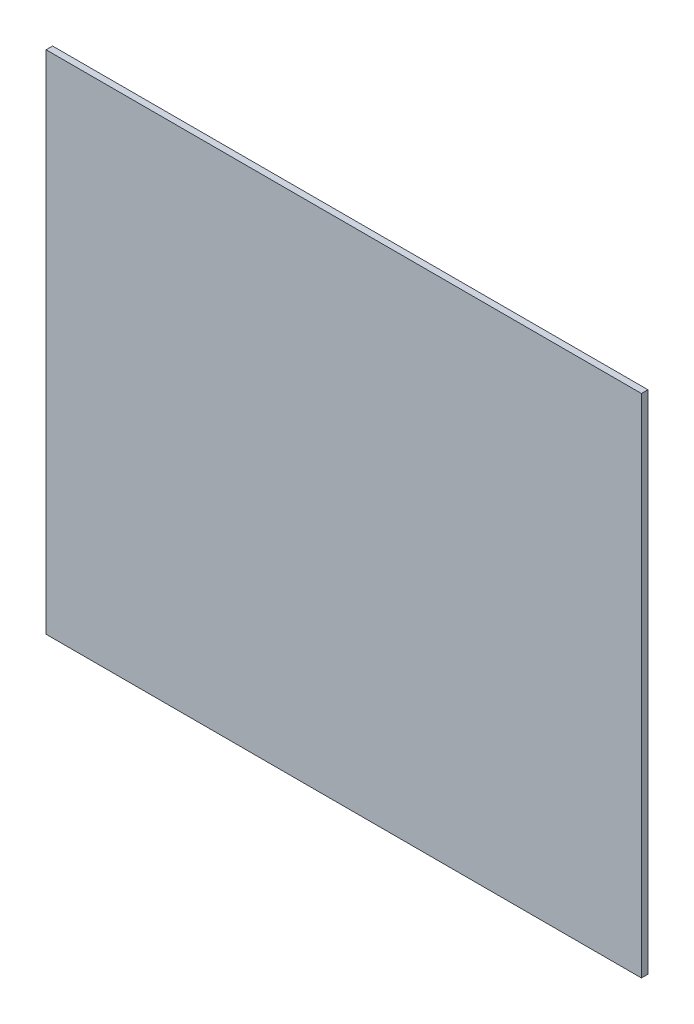
ISO-10303-21;
HEADER;
FILE_DESCRIPTION(('STEP AP214'),'2;1');
FILE_NAME('part.step','',(''),(''),'','','');
FILE_SCHEMA(('AUTOMOTIVE_DESIGN { 1 0 10303 214 1 1 1 1 }'));
ENDSEC;
DATA;
#1=APPLICATION_CONTEXT('core data for automotive mechanical design processes');
#2=APPLICATION_PROTOCOL_DEFINITION('international standard','automotive_design',2000,#1);
#3=PRODUCT_CONTEXT('',#1,'mechanical');
#4=PRODUCT('Part','Part','',(#3));
#5=PRODUCT_RELATED_PRODUCT_CATEGORY('part','',(#4));
#6=PRODUCT_DEFINITION_FORMATION('','',#4);
#7=PRODUCT_DEFINITION_CONTEXT('part definition',#1,'design');
#8=PRODUCT_DEFINITION('design','',#6,#7);
#9=PRODUCT_DEFINITION_SHAPE('','',#8);
#10=(LENGTH_UNIT() NAMED_UNIT(*) SI_UNIT(.MILLI.,.METRE.));
#11=(NAMED_UNIT(*) PLANE_ANGLE_UNIT() SI_UNIT($,.RADIAN.));
#12=(NAMED_UNIT(*) SI_UNIT($,.STERADIAN.) SOLID_ANGLE_UNIT());
#13=UNCERTAINTY_MEASURE_WITH_UNIT(LENGTH_MEASURE(1.E-05),#10,'distance_accuracy_value','');
#14=(GEOMETRIC_REPRESENTATION_CONTEXT(3) GLOBAL_UNCERTAINTY_ASSIGNED_CONTEXT((#13)) GLOBAL_UNIT_ASSIGNED_CONTEXT((#10,
#11,#12)) REPRESENTATION_CONTEXT('',''));
#15=CARTESIAN_POINT('',(0.,0.,0.));
#16=DIRECTION('',(0.,0.,1.));
#17=DIRECTION('',(1.,0.,0.));
#18=AXIS2_PLACEMENT_3D('',#15,#16,#17);
#19=CARTESIAN_POINT('',(-47.1466666666667,40.0228571428571,1.));
#20=DIRECTION('',(1.,0.,0.));
#21=DIRECTION('',(0.,0.,-1.));
#22=AXIS2_PLACEMENT_3D('',#19,#20,#21);
#23=PLANE('',#22);
#24=DIRECTION('',(0.,-1.,0.));
#25=VECTOR('',#24,1.);
#26=CARTESIAN_POINT('',(-47.1466666666667,40.0228571428571,0.));
#27=LINE('',#26,#25);
#28=CARTESIAN_POINT('',(-47.1466666666667,40.0228571428571,0.));
#29=VERTEX_POINT('',#28);
#30=CARTESIAN_POINT('',(-47.1466666666667,-37.9504761904762,0.));
#31=VERTEX_POINT('',#30);
#32=EDGE_CURVE('E96',#29,#31,#27,.T.);
#33=ORIENTED_EDGE('',*,*,#32,.T.);
#34=DIRECTION('',(0.,0.,-1.));
#35=VECTOR('',#34,1.);
#36=CARTESIAN_POINT('',(-47.1466666666667,-37.9504761904762,1.));
#37=LINE('',#36,#35);
#38=CARTESIAN_POINT('',(-47.1466666666667,-37.9504761904762,1.));
#39=VERTEX_POINT('',#38);
#40=EDGE_CURVE('E11',#39,#31,#37,.T.);
#41=ORIENTED_EDGE('',*,*,#40,.F.);
#42=DIRECTION('',(0.,-1.,0.));
#43=VECTOR('',#42,1.);
#44=CARTESIAN_POINT('',(-47.1466666666667,40.0228571428571,1.));
#45=LINE('',#44,#43);
#46=CARTESIAN_POINT('',(-47.1466666666667,40.0228571428571,1.));
#47=VERTEX_POINT('',#46);
#48=EDGE_CURVE('E84',#47,#39,#45,.T.);
#49=ORIENTED_EDGE('',*,*,#48,.F.);
#50=DIRECTION('',(0.,0.,-1.));
#51=VECTOR('',#50,1.);
#52=CARTESIAN_POINT('',(-47.1466666666667,40.0228571428571,1.));
#53=LINE('',#52,#51);
#54=EDGE_CURVE('E92',#47,#29,#53,.T.);
#55=ORIENTED_EDGE('',*,*,#54,.T.);
#56=EDGE_LOOP('',(#33,#41,#49,#55));
#57=FACE_BOUND('',#56,.T.);
#58=ADVANCED_FACE('F33',(#57),#23,.F.);
#59=CARTESIAN_POINT('',(-47.1466666666667,-37.9504761904762,1.));
#60=DIRECTION('',(0.,1.,0.));
#61=DIRECTION('',(0.,0.,1.));
#62=AXIS2_PLACEMENT_3D('',#59,#60,#61);
#63=PLANE('',#62);
#64=DIRECTION('',(1.,0.,0.));
#65=VECTOR('',#64,1.);
#66=CARTESIAN_POINT('',(-47.1466666666667,-37.9504761904762,0.));
#67=LINE('',#66,#65);
#68=CARTESIAN_POINT('',(44.5561904761905,-37.9504761904762,0.));
#69=VERTEX_POINT('',#68);
#70=EDGE_CURVE('E88',#31,#69,#67,.T.);
#71=ORIENTED_EDGE('',*,*,#70,.T.);
#72=DIRECTION('',(0.,0.,-1.));
#73=VECTOR('',#72,1.);
#74=CARTESIAN_POINT('',(44.5561904761905,-37.9504761904762,1.));
#75=LINE('',#74,#73);
#76=CARTESIAN_POINT('',(44.5561904761905,-37.9504761904762,1.));
#77=VERTEX_POINT('',#76);
#78=EDGE_CURVE('E41',#77,#69,#75,.T.);
#79=ORIENTED_EDGE('',*,*,#78,.F.);
#80=DIRECTION('',(1.,0.,0.));
#81=VECTOR('',#80,1.);
#82=CARTESIAN_POINT('',(-47.1466666666667,-37.9504761904762,1.));
#83=LINE('',#82,#81);
#84=EDGE_CURVE('E79',#39,#77,#83,.T.);
#85=ORIENTED_EDGE('',*,*,#84,.F.);
#86=ORIENTED_EDGE('',*,*,#40,.T.);
#87=EDGE_LOOP('',(#71,#79,#85,#86));
#88=FACE_BOUND('',#87,.T.);
#89=ADVANCED_FACE('F87',(#88),#63,.F.);
#90=CARTESIAN_POINT('',(44.5561904761905,40.0228571428571,1.));
#91=DIRECTION('',(-1.,0.,0.));
#92=DIRECTION('',(0.,0.,1.));
#93=AXIS2_PLACEMENT_3D('',#90,#91,#92);
#94=PLANE('',#93);
#95=DIRECTION('',(0.,1.,0.));
#96=VECTOR('',#95,1.);
#97=CARTESIAN_POINT('',(44.5561904761905,40.0228571428571,0.));
#98=LINE('',#97,#96);
#99=CARTESIAN_POINT('',(44.5561904761905,40.0228571428571,0.));
#100=VERTEX_POINT('',#99);
#101=EDGE_CURVE('E66',#69,#100,#98,.T.);
#102=ORIENTED_EDGE('',*,*,#101,.T.);
#103=DIRECTION('',(0.,0.,-1.));
#104=VECTOR('',#103,1.);
#105=CARTESIAN_POINT('',(44.5561904761905,40.0228571428571,1.));
#106=LINE('',#105,#104);
#107=CARTESIAN_POINT('',(44.5561904761905,40.0228571428571,1.));
#108=VERTEX_POINT('',#107);
#109=EDGE_CURVE('E89',#108,#100,#106,.T.);
#110=ORIENTED_EDGE('',*,*,#109,.F.);
#111=DIRECTION('',(0.,1.,0.));
#112=VECTOR('',#111,1.);
#113=CARTESIAN_POINT('',(44.5561904761905,40.0228571428571,1.));
#114=LINE('',#113,#112);
#115=EDGE_CURVE('E82',#77,#108,#114,.T.);
#116=ORIENTED_EDGE('',*,*,#115,.F.);
#117=ORIENTED_EDGE('',*,*,#78,.T.);
#118=EDGE_LOOP('',(#102,#110,#116,#117));
#119=FACE_BOUND('',#118,.T.);
#120=ADVANCED_FACE('F90',(#119),#94,.F.);
#121=CARTESIAN_POINT('',(-47.1466666666667,40.0228571428571,1.));
#122=DIRECTION('',(0.,-1.,0.));
#123=DIRECTION('',(0.,0.,-1.));
#124=AXIS2_PLACEMENT_3D('',#121,#122,#123);
#125=PLANE('',#124);
#126=DIRECTION('',(-1.,0.,0.));
#127=VECTOR('',#126,1.);
#128=CARTESIAN_POINT('',(-47.1466666666667,40.0228571428571,0.));
#129=LINE('',#128,#127);
#130=EDGE_CURVE('E72',#100,#29,#129,.T.);
#131=ORIENTED_EDGE('',*,*,#130,.T.);
#132=ORIENTED_EDGE('',*,*,#54,.F.);
#133=DIRECTION('',(-1.,0.,0.));
#134=VECTOR('',#133,1.);
#135=CARTESIAN_POINT('',(-47.1466666666667,40.0228571428571,1.));
#136=LINE('',#135,#134);
#137=EDGE_CURVE('E49',#108,#47,#136,.T.);
#138=ORIENTED_EDGE('',*,*,#137,.F.);
#139=ORIENTED_EDGE('',*,*,#109,.T.);
#140=EDGE_LOOP('',(#131,#132,#138,#139));
#141=FACE_BOUND('',#140,.T.);
#142=ADVANCED_FACE('F103',(#141),#125,.F.);
#143=CARTESIAN_POINT('',(0.,0.,1.));
#144=DIRECTION('',(0.,0.,1.));
#145=DIRECTION('',(1.,0.,0.));
#146=AXIS2_PLACEMENT_3D('',#143,#144,#145);
#147=PLANE('',#146);
#148=ORIENTED_EDGE('',*,*,#48,.T.);
#149=ORIENTED_EDGE('',*,*,#84,.T.);
#150=ORIENTED_EDGE('',*,*,#115,.T.);
#151=ORIENTED_EDGE('',*,*,#137,.T.);
#152=EDGE_LOOP('',(#148,#149,#150,#151));
#153=FACE_BOUND('',#152,.T.);
#154=ADVANCED_FACE('F80',(#153),#147,.T.);
#155=CARTESIAN_POINT('',(0.,0.,0.));
#156=DIRECTION('',(0.,0.,1.));
#157=DIRECTION('',(1.,0.,0.));
#158=AXIS2_PLACEMENT_3D('',#155,#156,#157);
#159=PLANE('',#158);
#160=ORIENTED_EDGE('',*,*,#32,.F.);
#161=ORIENTED_EDGE('',*,*,#130,.F.);
#162=ORIENTED_EDGE('',*,*,#101,.F.);
#163=ORIENTED_EDGE('',*,*,#70,.F.);
#164=EDGE_LOOP('',(#160,#161,#162,#163));
#165=FACE_BOUND('',#164,.T.);
#166=ADVANCED_FACE('F106',(#165),#159,.F.);
#167=CLOSED_SHELL('',(#58,#89,#120,#142,#154,#166));
#168=MANIFOLD_SOLID_BREP('B2',#167);
#169=ADVANCED_BREP_SHAPE_REPRESENTATION('',(#18,#168),#14);
#170=SHAPE_DEFINITION_REPRESENTATION(#9,#169);
ENDSEC;
END-ISO-10303-21;
